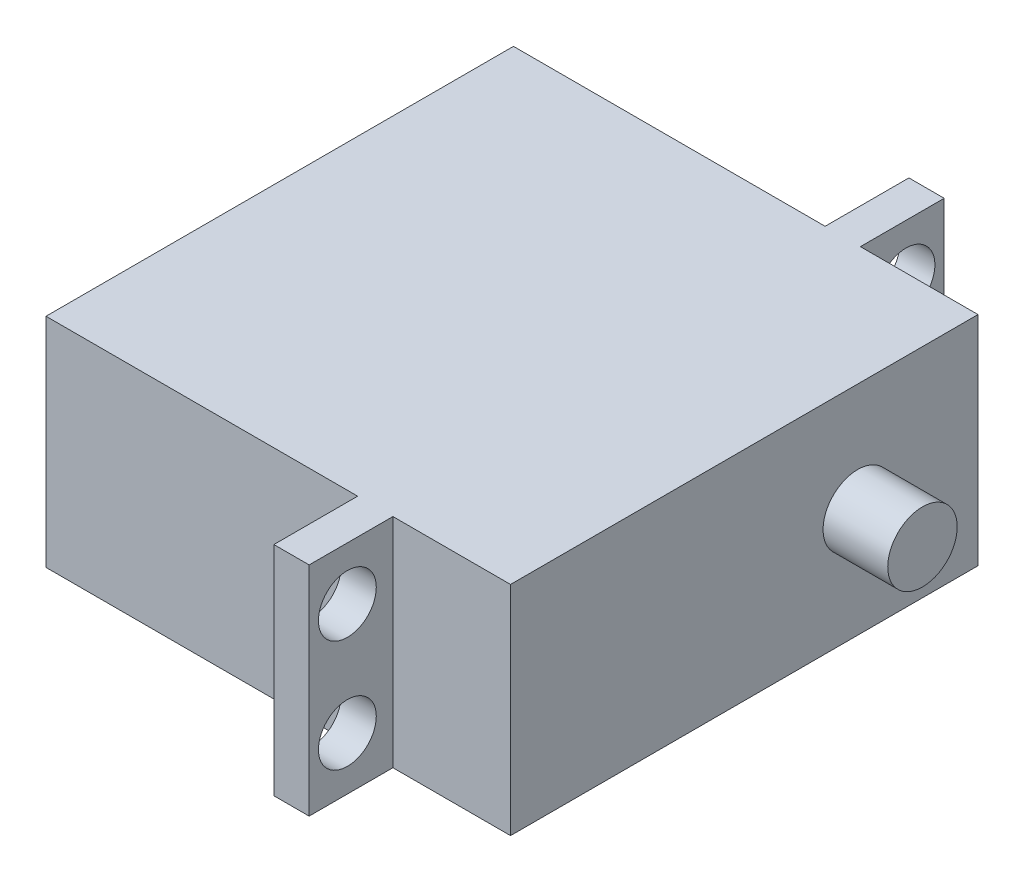
ISO-10303-21;
HEADER;
FILE_DESCRIPTION(('STEP AP214'),'2;1');
FILE_NAME('part.step','',(''),(''),'','','');
FILE_SCHEMA(('AUTOMOTIVE_DESIGN { 1 0 10303 214 1 1 1 1 }'));
ENDSEC;
DATA;
#1=APPLICATION_CONTEXT('core data for automotive mechanical design processes');
#2=APPLICATION_PROTOCOL_DEFINITION('international standard','automotive_design',2000,#1);
#3=PRODUCT_CONTEXT('',#1,'mechanical');
#4=PRODUCT('Part','Part','',(#3));
#5=PRODUCT_RELATED_PRODUCT_CATEGORY('part','',(#4));
#6=PRODUCT_DEFINITION_FORMATION('','',#4);
#7=PRODUCT_DEFINITION_CONTEXT('part definition',#1,'design');
#8=PRODUCT_DEFINITION('design','',#6,#7);
#9=PRODUCT_DEFINITION_SHAPE('','',#8);
#10=(LENGTH_UNIT() NAMED_UNIT(*) SI_UNIT(.MILLI.,.METRE.));
#11=(NAMED_UNIT(*) PLANE_ANGLE_UNIT() SI_UNIT($,.RADIAN.));
#12=(NAMED_UNIT(*) SI_UNIT($,.STERADIAN.) SOLID_ANGLE_UNIT());
#13=UNCERTAINTY_MEASURE_WITH_UNIT(LENGTH_MEASURE(1.E-05),#10,'distance_accuracy_value','');
#14=(GEOMETRIC_REPRESENTATION_CONTEXT(3) GLOBAL_UNCERTAINTY_ASSIGNED_CONTEXT((#13)) GLOBAL_UNIT_ASSIGNED_CONTEXT((#10,
#11,#12)) REPRESENTATION_CONTEXT('',''));
#15=CARTESIAN_POINT('',(0.,0.,0.));
#16=DIRECTION('',(0.,0.,1.));
#17=DIRECTION('',(1.,0.,0.));
#18=AXIS2_PLACEMENT_3D('',#15,#16,#17);
#19=CARTESIAN_POINT('',(40.132,0.,0.));
#20=DIRECTION('',(0.,0.,1.));
#21=DIRECTION('',(0.,-1.,0.));
#22=AXIS2_PLACEMENT_3D('',#19,#20,#21);
#23=PLANE('',#22);
#24=DIRECTION('',(0.,-1.,0.));
#25=VECTOR('',#24,1.);
#26=CARTESIAN_POINT('',(29.972,0.,0.));
#27=LINE('',#26,#25);
#28=CARTESIAN_POINT('',(29.972,0.,0.));
#29=VERTEX_POINT('',#28);
#30=CARTESIAN_POINT('',(29.972,-18.796,0.));
#31=VERTEX_POINT('',#30);
#32=EDGE_CURVE('E132',#29,#31,#27,.T.);
#33=ORIENTED_EDGE('',*,*,#32,.F.);
#34=DIRECTION('',(-1.,0.,0.));
#35=VECTOR('',#34,1.);
#36=CARTESIAN_POINT('',(40.132,0.,0.));
#37=LINE('',#36,#35);
#38=CARTESIAN_POINT('',(40.132,0.,0.));
#39=VERTEX_POINT('',#38);
#40=EDGE_CURVE('E48',#39,#29,#37,.T.);
#41=ORIENTED_EDGE('',*,*,#40,.F.);
#42=DIRECTION('',(0.,1.,0.));
#43=VECTOR('',#42,1.);
#44=CARTESIAN_POINT('',(40.132,0.,0.));
#45=LINE('',#44,#43);
#46=CARTESIAN_POINT('',(40.132,-18.796,0.));
#47=VERTEX_POINT('',#46);
#48=EDGE_CURVE('E135',#47,#39,#45,.T.);
#49=ORIENTED_EDGE('',*,*,#48,.F.);
#50=DIRECTION('',(-1.,0.,0.));
#51=VECTOR('',#50,1.);
#52=CARTESIAN_POINT('',(40.132,-18.796,0.));
#53=LINE('',#52,#51);
#54=EDGE_CURVE('E128',#47,#31,#53,.T.);
#55=ORIENTED_EDGE('',*,*,#54,.T.);
#56=EDGE_LOOP('',(#33,#41,#49,#55));
#57=FACE_BOUND('',#56,.T.);
#58=ADVANCED_FACE('F39',(#57),#23,.F.);
#59=CARTESIAN_POINT('',(40.132,0.,40.386));
#60=DIRECTION('',(0.,0.,-1.));
#61=DIRECTION('',(-1.,0.,0.));
#62=AXIS2_PLACEMENT_3D('',#59,#60,#61);
#63=PLANE('',#62);
#64=DIRECTION('',(0.,1.,0.));
#65=VECTOR('',#64,1.);
#66=CARTESIAN_POINT('',(29.972,0.,40.386));
#67=LINE('',#66,#65);
#68=CARTESIAN_POINT('',(29.972,-18.796,40.386));
#69=VERTEX_POINT('',#68);
#70=CARTESIAN_POINT('',(29.972,0.,40.386));
#71=VERTEX_POINT('',#70);
#72=EDGE_CURVE('E203',#69,#71,#67,.T.);
#73=ORIENTED_EDGE('',*,*,#72,.F.);
#74=DIRECTION('',(-1.,0.,0.));
#75=VECTOR('',#74,1.);
#76=CARTESIAN_POINT('',(40.132,-18.796,40.386));
#77=LINE('',#76,#75);
#78=CARTESIAN_POINT('',(40.132,-18.796,40.386));
#79=VERTEX_POINT('',#78);
#80=EDGE_CURVE('E262',#79,#69,#77,.T.);
#81=ORIENTED_EDGE('',*,*,#80,.F.);
#82=DIRECTION('',(0.,-1.,0.));
#83=VECTOR('',#82,1.);
#84=CARTESIAN_POINT('',(40.132,0.,40.386));
#85=LINE('',#84,#83);
#86=CARTESIAN_POINT('',(40.132,0.,40.386));
#87=VERTEX_POINT('',#86);
#88=EDGE_CURVE('E244',#87,#79,#85,.T.);
#89=ORIENTED_EDGE('',*,*,#88,.F.);
#90=DIRECTION('',(-1.,0.,0.));
#91=VECTOR('',#90,1.);
#92=CARTESIAN_POINT('',(40.132,0.,40.386));
#93=LINE('',#92,#91);
#94=EDGE_CURVE('E267',#87,#71,#93,.T.);
#95=ORIENTED_EDGE('',*,*,#94,.T.);
#96=EDGE_LOOP('',(#73,#81,#89,#95));
#97=FACE_BOUND('',#96,.T.);
#98=ADVANCED_FACE('F308',(#97),#63,.F.);
#99=CARTESIAN_POINT('',(26.924,0.,0.));
#100=VERTEX_POINT('',#99);
#101=CARTESIAN_POINT('',(0.,0.,0.));
#102=VERTEX_POINT('',#101);
#103=EDGE_CURVE('E60',#100,#102,#37,.T.);
#104=ORIENTED_EDGE('',*,*,#103,.F.);
#105=DIRECTION('',(0.,-1.,0.));
#106=VECTOR('',#105,1.);
#107=CARTESIAN_POINT('',(26.924,0.,0.));
#108=LINE('',#107,#106);
#109=CARTESIAN_POINT('',(26.924,-18.796,0.));
#110=VERTEX_POINT('',#109);
#111=EDGE_CURVE('E55',#100,#110,#108,.T.);
#112=ORIENTED_EDGE('',*,*,#111,.T.);
#113=CARTESIAN_POINT('',(0.,-18.796,0.));
#114=VERTEX_POINT('',#113);
#115=EDGE_CURVE('E140',#110,#114,#53,.T.);
#116=ORIENTED_EDGE('',*,*,#115,.T.);
#117=DIRECTION('',(0.,1.,0.));
#118=VECTOR('',#117,1.);
#119=CARTESIAN_POINT('',(0.,0.,0.));
#120=LINE('',#119,#118);
#121=EDGE_CURVE('E237',#114,#102,#120,.T.);
#122=ORIENTED_EDGE('',*,*,#121,.T.);
#123=EDGE_LOOP('',(#104,#112,#116,#122));
#124=FACE_BOUND('',#123,.T.);
#125=ADVANCED_FACE('F41',(#124),#23,.F.);
#126=CARTESIAN_POINT('',(40.132,0.,0.));
#127=DIRECTION('',(0.,-1.,0.));
#128=DIRECTION('',(0.,0.,-1.));
#129=AXIS2_PLACEMENT_3D('',#126,#127,#128);
#130=PLANE('',#129);
#131=DIRECTION('',(0.,0.,1.));
#132=VECTOR('',#131,1.);
#133=CARTESIAN_POINT('',(0.,0.,0.));
#134=LINE('',#133,#132);
#135=CARTESIAN_POINT('',(0.,0.,40.386));
#136=VERTEX_POINT('',#135);
#137=EDGE_CURVE('E252',#102,#136,#134,.T.);
#138=ORIENTED_EDGE('',*,*,#137,.T.);
#139=CARTESIAN_POINT('',(26.924,0.,40.386));
#140=VERTEX_POINT('',#139);
#141=EDGE_CURVE('E266',#140,#136,#93,.T.);
#142=ORIENTED_EDGE('',*,*,#141,.F.);
#143=DIRECTION('',(0.,0.,1.));
#144=VECTOR('',#143,1.);
#145=CARTESIAN_POINT('',(26.924,0.,40.386));
#146=LINE('',#145,#144);
#147=CARTESIAN_POINT('',(26.924,0.,47.625));
#148=VERTEX_POINT('',#147);
#149=EDGE_CURVE('E221',#140,#148,#146,.T.);
#150=ORIENTED_EDGE('',*,*,#149,.T.);
#151=DIRECTION('',(-1.,0.,0.));
#152=VECTOR('',#151,1.);
#153=CARTESIAN_POINT('',(29.972,0.,47.625));
#154=LINE('',#153,#152);
#155=CARTESIAN_POINT('',(29.972,0.,47.625));
#156=VERTEX_POINT('',#155);
#157=EDGE_CURVE('E233',#156,#148,#154,.T.);
#158=ORIENTED_EDGE('',*,*,#157,.F.);
#159=DIRECTION('',(0.,0.,1.));
#160=VECTOR('',#159,1.);
#161=CARTESIAN_POINT('',(29.972,0.,40.386));
#162=LINE('',#161,#160);
#163=EDGE_CURVE('E207',#71,#156,#162,.T.);
#164=ORIENTED_EDGE('',*,*,#163,.F.);
#165=ORIENTED_EDGE('',*,*,#94,.F.);
#166=DIRECTION('',(0.,0.,1.));
#167=VECTOR('',#166,1.);
#168=CARTESIAN_POINT('',(40.132,0.,0.));
#169=LINE('',#168,#167);
#170=EDGE_CURVE('E240',#39,#87,#169,.T.);
#171=ORIENTED_EDGE('',*,*,#170,.F.);
#172=ORIENTED_EDGE('',*,*,#40,.T.);
#173=DIRECTION('',(0.,0.,1.));
#174=VECTOR('',#173,1.);
#175=CARTESIAN_POINT('',(29.972,0.,0.));
#176=LINE('',#175,#174);
#177=CARTESIAN_POINT('',(29.972,0.,-7.239));
#178=VERTEX_POINT('',#177);
#179=EDGE_CURVE('E157',#178,#29,#176,.T.);
#180=ORIENTED_EDGE('',*,*,#179,.F.);
#181=DIRECTION('',(-1.,0.,0.));
#182=VECTOR('',#181,1.);
#183=CARTESIAN_POINT('',(29.972,0.,-7.239));
#184=LINE('',#183,#182);
#185=CARTESIAN_POINT('',(26.924,0.,-7.239));
#186=VERTEX_POINT('',#185);
#187=EDGE_CURVE('E172',#178,#186,#184,.T.);
#188=ORIENTED_EDGE('',*,*,#187,.T.);
#189=DIRECTION('',(0.,0.,1.));
#190=VECTOR('',#189,1.);
#191=CARTESIAN_POINT('',(26.924,0.,0.));
#192=LINE('',#191,#190);
#193=EDGE_CURVE('E159',#186,#100,#192,.T.);
#194=ORIENTED_EDGE('',*,*,#193,.T.);
#195=ORIENTED_EDGE('',*,*,#103,.T.);
#196=EDGE_LOOP('',(#138,#142,#150,#158,#164,#165,#171,#172,#180,#188,#194,#195));
#197=FACE_BOUND('',#196,.T.);
#198=ADVANCED_FACE('F273',(#197),#130,.F.);
#199=CARTESIAN_POINT('',(26.924,-18.796,40.386));
#200=VERTEX_POINT('',#199);
#201=CARTESIAN_POINT('',(0.,-18.796,40.386));
#202=VERTEX_POINT('',#201);
#203=EDGE_CURVE('E139',#200,#202,#77,.T.);
#204=ORIENTED_EDGE('',*,*,#203,.F.);
#205=DIRECTION('',(0.,1.,0.));
#206=VECTOR('',#205,1.);
#207=CARTESIAN_POINT('',(26.924,0.,40.386));
#208=LINE('',#207,#206);
#209=EDGE_CURVE('E199',#200,#140,#208,.T.);
#210=ORIENTED_EDGE('',*,*,#209,.T.);
#211=ORIENTED_EDGE('',*,*,#141,.T.);
#212=DIRECTION('',(0.,-1.,0.));
#213=VECTOR('',#212,1.);
#214=CARTESIAN_POINT('',(0.,0.,40.386));
#215=LINE('',#214,#213);
#216=EDGE_CURVE('E256',#136,#202,#215,.T.);
#217=ORIENTED_EDGE('',*,*,#216,.T.);
#218=EDGE_LOOP('',(#204,#210,#211,#217));
#219=FACE_BOUND('',#218,.T.);
#220=ADVANCED_FACE('F287',(#219),#63,.F.);
#221=CARTESIAN_POINT('',(40.132,-18.796,0.));
#222=DIRECTION('',(0.,1.,0.));
#223=DIRECTION('',(0.,0.,1.));
#224=AXIS2_PLACEMENT_3D('',#221,#222,#223);
#225=PLANE('',#224);
#226=DIRECTION('',(0.,0.,-1.));
#227=VECTOR('',#226,1.);
#228=CARTESIAN_POINT('',(0.,-18.796,0.));
#229=LINE('',#228,#227);
#230=EDGE_CURVE('E241',#202,#114,#229,.T.);
#231=ORIENTED_EDGE('',*,*,#230,.T.);
#232=ORIENTED_EDGE('',*,*,#115,.F.);
#233=DIRECTION('',(0.,0.,-1.));
#234=VECTOR('',#233,1.);
#235=CARTESIAN_POINT('',(26.924,-18.796,0.));
#236=LINE('',#235,#234);
#237=CARTESIAN_POINT('',(26.924,-18.796,-7.239));
#238=VERTEX_POINT('',#237);
#239=EDGE_CURVE('E175',#110,#238,#236,.T.);
#240=ORIENTED_EDGE('',*,*,#239,.T.);
#241=DIRECTION('',(-1.,0.,0.));
#242=VECTOR('',#241,1.);
#243=CARTESIAN_POINT('',(29.972,-18.796,-7.239));
#244=LINE('',#243,#242);
#245=CARTESIAN_POINT('',(29.972,-18.796,-7.239));
#246=VERTEX_POINT('',#245);
#247=EDGE_CURVE('E147',#246,#238,#244,.T.);
#248=ORIENTED_EDGE('',*,*,#247,.F.);
#249=DIRECTION('',(0.,0.,-1.));
#250=VECTOR('',#249,1.);
#251=CARTESIAN_POINT('',(29.972,-18.796,0.));
#252=LINE('',#251,#250);
#253=EDGE_CURVE('E143',#31,#246,#252,.T.);
#254=ORIENTED_EDGE('',*,*,#253,.F.);
#255=ORIENTED_EDGE('',*,*,#54,.F.);
#256=DIRECTION('',(0.,0.,-1.));
#257=VECTOR('',#256,1.);
#258=CARTESIAN_POINT('',(40.132,-18.796,0.));
#259=LINE('',#258,#257);
#260=EDGE_CURVE('E247',#79,#47,#259,.T.);
#261=ORIENTED_EDGE('',*,*,#260,.F.);
#262=ORIENTED_EDGE('',*,*,#80,.T.);
#263=DIRECTION('',(0.,0.,-1.));
#264=VECTOR('',#263,1.);
#265=CARTESIAN_POINT('',(29.972,-18.796,40.386));
#266=LINE('',#265,#264);
#267=CARTESIAN_POINT('',(29.972,-18.796,47.625));
#268=VERTEX_POINT('',#267);
#269=EDGE_CURVE('E214',#268,#69,#266,.T.);
#270=ORIENTED_EDGE('',*,*,#269,.F.);
#271=DIRECTION('',(-1.,0.,0.));
#272=VECTOR('',#271,1.);
#273=CARTESIAN_POINT('',(29.972,-18.796,47.625));
#274=LINE('',#273,#272);
#275=CARTESIAN_POINT('',(26.924,-18.796,47.625));
#276=VERTEX_POINT('',#275);
#277=EDGE_CURVE('E218',#268,#276,#274,.T.);
#278=ORIENTED_EDGE('',*,*,#277,.T.);
#279=DIRECTION('',(0.,0.,-1.));
#280=VECTOR('',#279,1.);
#281=CARTESIAN_POINT('',(26.924,-18.796,40.386));
#282=LINE('',#281,#280);
#283=EDGE_CURVE('E208',#276,#200,#282,.T.);
#284=ORIENTED_EDGE('',*,*,#283,.T.);
#285=ORIENTED_EDGE('',*,*,#203,.T.);
#286=EDGE_LOOP('',(#231,#232,#240,#248,#254,#255,#261,#262,#270,#278,#284,#285));
#287=FACE_BOUND('',#286,.T.);
#288=ADVANCED_FACE('F145',(#287),#225,.F.);
#289=CARTESIAN_POINT('',(40.132,0.,0.));
#290=DIRECTION('',(-1.,0.,0.));
#291=DIRECTION('',(0.,0.,1.));
#292=AXIS2_PLACEMENT_3D('',#289,#290,#291);
#293=PLANE('',#292);
#294=CARTESIAN_POINT('',(40.132,-9.398,10.386));
#295=DIRECTION('',(-1.,0.,0.));
#296=DIRECTION('',(0.,0.,1.));
#297=AXIS2_PLACEMENT_3D('',#294,#295,#296);
#298=CIRCLE('',#297,3.);
#299=CARTESIAN_POINT('',(40.132,-9.398,13.386));
#300=VERTEX_POINT('',#299);
#301=EDGE_CURVE('E11',#300,#300,#298,.F.);
#302=ORIENTED_EDGE('',*,*,#301,.F.);
#303=EDGE_LOOP('',(#302));
#304=FACE_BOUND('',#303,.T.);
#305=ORIENTED_EDGE('',*,*,#48,.T.);
#306=ORIENTED_EDGE('',*,*,#170,.T.);
#307=ORIENTED_EDGE('',*,*,#88,.T.);
#308=ORIENTED_EDGE('',*,*,#260,.T.);
#309=EDGE_LOOP('',(#305,#306,#307,#308));
#310=FACE_BOUND('',#309,.T.);
#311=ADVANCED_FACE('F310',(#304,#310),#293,.F.);
#312=CARTESIAN_POINT('',(0.,0.,0.));
#313=DIRECTION('',(-1.,0.,0.));
#314=DIRECTION('',(0.,0.,1.));
#315=AXIS2_PLACEMENT_3D('',#312,#313,#314);
#316=PLANE('',#315);
#317=ORIENTED_EDGE('',*,*,#121,.F.);
#318=ORIENTED_EDGE('',*,*,#230,.F.);
#319=ORIENTED_EDGE('',*,*,#216,.F.);
#320=ORIENTED_EDGE('',*,*,#137,.F.);
#321=EDGE_LOOP('',(#317,#318,#319,#320));
#322=FACE_BOUND('',#321,.T.);
#323=ADVANCED_FACE('F279',(#322),#316,.T.);
#324=CARTESIAN_POINT('',(29.972,0.,0.));
#325=DIRECTION('',(-1.,0.,0.));
#326=DIRECTION('',(0.,0.,1.));
#327=AXIS2_PLACEMENT_3D('',#324,#325,#326);
#328=PLANE('',#327);
#329=ORIENTED_EDGE('',*,*,#72,.T.);
#330=ORIENTED_EDGE('',*,*,#163,.T.);
#331=DIRECTION('',(0.,-1.,0.));
#332=VECTOR('',#331,1.);
#333=CARTESIAN_POINT('',(29.972,0.,47.625));
#334=LINE('',#333,#332);
#335=EDGE_CURVE('E211',#156,#268,#334,.T.);
#336=ORIENTED_EDGE('',*,*,#335,.T.);
#337=ORIENTED_EDGE('',*,*,#269,.T.);
#338=EDGE_LOOP('',(#329,#330,#336,#337));
#339=FACE_BOUND('',#338,.T.);
#340=CARTESIAN_POINT('',(29.972,-4.572,44.323));
#341=DIRECTION('',(1.,0.,0.));
#342=DIRECTION('',(0.,0.,-1.));
#343=AXIS2_PLACEMENT_3D('',#340,#341,#342);
#344=CIRCLE('',#343,2.5);
#345=CARTESIAN_POINT('',(29.972,-4.572,41.823));
#346=VERTEX_POINT('',#345);
#347=EDGE_CURVE('E195',#346,#346,#344,.T.);
#348=ORIENTED_EDGE('',*,*,#347,.F.);
#349=EDGE_LOOP('',(#348));
#350=FACE_BOUND('',#349,.T.);
#351=CARTESIAN_POINT('',(29.972,-14.224,44.323));
#352=DIRECTION('',(1.,0.,0.));
#353=DIRECTION('',(0.,0.,-1.));
#354=AXIS2_PLACEMENT_3D('',#351,#352,#353);
#355=CIRCLE('',#354,2.5);
#356=CARTESIAN_POINT('',(29.972,-14.224,41.823));
#357=VERTEX_POINT('',#356);
#358=EDGE_CURVE('E187',#357,#357,#355,.T.);
#359=ORIENTED_EDGE('',*,*,#358,.F.);
#360=EDGE_LOOP('',(#359));
#361=FACE_BOUND('',#360,.T.);
#362=ADVANCED_FACE('F302',(#339,#350,#361),#328,.F.);
#363=CARTESIAN_POINT('',(26.924,0.,0.));
#364=DIRECTION('',(-1.,0.,0.));
#365=DIRECTION('',(0.,0.,1.));
#366=AXIS2_PLACEMENT_3D('',#363,#364,#365);
#367=PLANE('',#366);
#368=CARTESIAN_POINT('',(26.924,-4.572,44.323));
#369=DIRECTION('',(1.,0.,0.));
#370=DIRECTION('',(0.,0.,-1.));
#371=AXIS2_PLACEMENT_3D('',#368,#369,#370);
#372=CIRCLE('',#371,2.5);
#373=CARTESIAN_POINT('',(26.924,-4.572,41.823));
#374=VERTEX_POINT('',#373);
#375=EDGE_CURVE('E191',#374,#374,#372,.T.);
#376=ORIENTED_EDGE('',*,*,#375,.T.);
#377=EDGE_LOOP('',(#376));
#378=FACE_BOUND('',#377,.T.);
#379=ORIENTED_EDGE('',*,*,#209,.F.);
#380=ORIENTED_EDGE('',*,*,#283,.F.);
#381=DIRECTION('',(0.,-1.,0.));
#382=VECTOR('',#381,1.);
#383=CARTESIAN_POINT('',(26.924,0.,47.625));
#384=LINE('',#383,#382);
#385=EDGE_CURVE('E224',#148,#276,#384,.T.);
#386=ORIENTED_EDGE('',*,*,#385,.F.);
#387=ORIENTED_EDGE('',*,*,#149,.F.);
#388=EDGE_LOOP('',(#379,#380,#386,#387));
#389=FACE_BOUND('',#388,.T.);
#390=CARTESIAN_POINT('',(26.924,-14.224,44.323));
#391=DIRECTION('',(1.,0.,0.));
#392=DIRECTION('',(0.,0.,-1.));
#393=AXIS2_PLACEMENT_3D('',#390,#391,#392);
#394=CIRCLE('',#393,2.5);
#395=CARTESIAN_POINT('',(26.924,-14.224,41.823));
#396=VERTEX_POINT('',#395);
#397=EDGE_CURVE('E186',#396,#396,#394,.T.);
#398=ORIENTED_EDGE('',*,*,#397,.T.);
#399=EDGE_LOOP('',(#398));
#400=FACE_BOUND('',#399,.T.);
#401=ADVANCED_FACE('F293',(#378,#389,#400),#367,.T.);
#402=CARTESIAN_POINT('',(29.972,0.,47.625));
#403=DIRECTION('',(0.,0.,-1.));
#404=DIRECTION('',(-1.,0.,0.));
#405=AXIS2_PLACEMENT_3D('',#402,#403,#404);
#406=PLANE('',#405);
#407=ORIENTED_EDGE('',*,*,#385,.T.);
#408=ORIENTED_EDGE('',*,*,#277,.F.);
#409=ORIENTED_EDGE('',*,*,#335,.F.);
#410=ORIENTED_EDGE('',*,*,#157,.T.);
#411=EDGE_LOOP('',(#407,#408,#409,#410));
#412=FACE_BOUND('',#411,.T.);
#413=ADVANCED_FACE('F297',(#412),#406,.F.);
#414=CARTESIAN_POINT('',(29.972,-4.572,44.323));
#415=DIRECTION('',(-1.,0.,0.));
#416=DIRECTION('',(0.,0.,1.));
#417=AXIS2_PLACEMENT_3D('',#414,#415,#416);
#418=CYLINDRICAL_SURFACE('',#417,2.5);
#419=ORIENTED_EDGE('',*,*,#347,.T.);
#420=EDGE_LOOP('',(#419));
#421=FACE_BOUND('',#420,.T.);
#422=ORIENTED_EDGE('',*,*,#375,.F.);
#423=EDGE_LOOP('',(#422));
#424=FACE_BOUND('',#423,.T.);
#425=ADVANCED_FACE('F367',(#421,#424),#418,.F.);
#426=CARTESIAN_POINT('',(29.972,-14.224,44.323));
#427=DIRECTION('',(-1.,0.,0.));
#428=DIRECTION('',(0.,0.,1.));
#429=AXIS2_PLACEMENT_3D('',#426,#427,#428);
#430=CYLINDRICAL_SURFACE('',#429,2.5);
#431=ORIENTED_EDGE('',*,*,#358,.T.);
#432=EDGE_LOOP('',(#431));
#433=FACE_BOUND('',#432,.T.);
#434=ORIENTED_EDGE('',*,*,#397,.F.);
#435=EDGE_LOOP('',(#434));
#436=FACE_BOUND('',#435,.T.);
#437=ADVANCED_FACE('F375',(#433,#436),#430,.F.);
#438=CARTESIAN_POINT('',(29.972,0.,0.));
#439=DIRECTION('',(1.,0.,0.));
#440=DIRECTION('',(0.,0.,-1.));
#441=AXIS2_PLACEMENT_3D('',#438,#439,#440);
#442=PLANE('',#441);
#443=CARTESIAN_POINT('',(29.972,-4.572,-3.937));
#444=DIRECTION('',(1.,0.,0.));
#445=DIRECTION('',(0.,0.,1.));
#446=AXIS2_PLACEMENT_3D('',#443,#444,#445);
#447=CIRCLE('',#446,2.5);
#448=CARTESIAN_POINT('',(29.972,-4.572,-1.437));
#449=VERTEX_POINT('',#448);
#450=EDGE_CURVE('E176',#449,#449,#447,.T.);
#451=ORIENTED_EDGE('',*,*,#450,.F.);
#452=EDGE_LOOP('',(#451));
#453=FACE_BOUND('',#452,.T.);
#454=ORIENTED_EDGE('',*,*,#32,.T.);
#455=ORIENTED_EDGE('',*,*,#253,.T.);
#456=DIRECTION('',(0.,1.,0.));
#457=VECTOR('',#456,1.);
#458=CARTESIAN_POINT('',(29.972,0.,-7.239));
#459=LINE('',#458,#457);
#460=EDGE_CURVE('E151',#246,#178,#459,.T.);
#461=ORIENTED_EDGE('',*,*,#460,.T.);
#462=ORIENTED_EDGE('',*,*,#179,.T.);
#463=EDGE_LOOP('',(#454,#455,#461,#462));
#464=FACE_BOUND('',#463,.T.);
#465=CARTESIAN_POINT('',(29.972,-14.224,-3.937));
#466=DIRECTION('',(1.,0.,0.));
#467=DIRECTION('',(0.,0.,1.));
#468=AXIS2_PLACEMENT_3D('',#465,#466,#467);
#469=CIRCLE('',#468,2.5);
#470=CARTESIAN_POINT('',(29.972,-14.224,-1.437));
#471=VERTEX_POINT('',#470);
#472=EDGE_CURVE('E472',#471,#471,#469,.T.);
#473=ORIENTED_EDGE('',*,*,#472,.F.);
#474=EDGE_LOOP('',(#473));
#475=FACE_BOUND('',#474,.T.);
#476=ADVANCED_FACE('F154',(#453,#464,#475),#442,.T.);
#477=CARTESIAN_POINT('',(26.924,0.,0.));
#478=DIRECTION('',(1.,0.,0.));
#479=DIRECTION('',(0.,0.,-1.));
#480=AXIS2_PLACEMENT_3D('',#477,#478,#479);
#481=PLANE('',#480);
#482=ORIENTED_EDGE('',*,*,#111,.F.);
#483=ORIENTED_EDGE('',*,*,#193,.F.);
#484=DIRECTION('',(0.,1.,0.));
#485=VECTOR('',#484,1.);
#486=CARTESIAN_POINT('',(26.924,0.,-7.239));
#487=LINE('',#486,#485);
#488=EDGE_CURVE('E162',#238,#186,#487,.T.);
#489=ORIENTED_EDGE('',*,*,#488,.F.);
#490=ORIENTED_EDGE('',*,*,#239,.F.);
#491=EDGE_LOOP('',(#482,#483,#489,#490));
#492=FACE_BOUND('',#491,.T.);
#493=CARTESIAN_POINT('',(26.924,-4.572,-3.937));
#494=DIRECTION('',(1.,0.,0.));
#495=DIRECTION('',(0.,0.,1.));
#496=AXIS2_PLACEMENT_3D('',#493,#494,#495);
#497=CIRCLE('',#496,2.5);
#498=CARTESIAN_POINT('',(26.924,-4.572,-1.437));
#499=VERTEX_POINT('',#498);
#500=EDGE_CURVE('E165',#499,#499,#497,.T.);
#501=ORIENTED_EDGE('',*,*,#500,.T.);
#502=EDGE_LOOP('',(#501));
#503=FACE_BOUND('',#502,.T.);
#504=CARTESIAN_POINT('',(26.924,-14.224,-3.937));
#505=DIRECTION('',(1.,0.,0.));
#506=DIRECTION('',(0.,0.,1.));
#507=AXIS2_PLACEMENT_3D('',#504,#505,#506);
#508=CIRCLE('',#507,2.5);
#509=CARTESIAN_POINT('',(26.924,-14.224,-1.437));
#510=VERTEX_POINT('',#509);
#511=EDGE_CURVE('E468',#510,#510,#508,.T.);
#512=ORIENTED_EDGE('',*,*,#511,.T.);
#513=EDGE_LOOP('',(#512));
#514=FACE_BOUND('',#513,.T.);
#515=ADVANCED_FACE('F394',(#492,#503,#514),#481,.F.);
#516=CARTESIAN_POINT('',(29.972,0.,-7.239));
#517=DIRECTION('',(0.,0.,1.));
#518=DIRECTION('',(1.,0.,0.));
#519=AXIS2_PLACEMENT_3D('',#516,#517,#518);
#520=PLANE('',#519);
#521=ORIENTED_EDGE('',*,*,#488,.T.);
#522=ORIENTED_EDGE('',*,*,#187,.F.);
#523=ORIENTED_EDGE('',*,*,#460,.F.);
#524=ORIENTED_EDGE('',*,*,#247,.T.);
#525=EDGE_LOOP('',(#521,#522,#523,#524));
#526=FACE_BOUND('',#525,.T.);
#527=ADVANCED_FACE('F404',(#526),#520,.F.);
#528=CARTESIAN_POINT('',(29.972,-4.572,-3.937));
#529=DIRECTION('',(-1.,0.,0.));
#530=DIRECTION('',(0.,0.,1.));
#531=AXIS2_PLACEMENT_3D('',#528,#529,#530);
#532=CYLINDRICAL_SURFACE('',#531,2.5);
#533=ORIENTED_EDGE('',*,*,#450,.T.);
#534=EDGE_LOOP('',(#533));
#535=FACE_BOUND('',#534,.T.);
#536=ORIENTED_EDGE('',*,*,#500,.F.);
#537=EDGE_LOOP('',(#536));
#538=FACE_BOUND('',#537,.T.);
#539=ADVANCED_FACE('F414',(#535,#538),#532,.F.);
#540=CARTESIAN_POINT('',(29.972,-14.224,-3.937));
#541=DIRECTION('',(-1.,0.,0.));
#542=DIRECTION('',(0.,0.,1.));
#543=AXIS2_PLACEMENT_3D('',#540,#541,#542);
#544=CYLINDRICAL_SURFACE('',#543,2.5);
#545=ORIENTED_EDGE('',*,*,#472,.T.);
#546=EDGE_LOOP('',(#545));
#547=FACE_BOUND('',#546,.T.);
#548=ORIENTED_EDGE('',*,*,#511,.F.);
#549=EDGE_LOOP('',(#548));
#550=FACE_BOUND('',#549,.T.);
#551=ADVANCED_FACE('F424',(#547,#550),#544,.F.);
#552=CARTESIAN_POINT('',(45.72,-9.398,10.386));
#553=DIRECTION('',(-1.,0.,0.));
#554=DIRECTION('',(0.,0.,1.));
#555=AXIS2_PLACEMENT_3D('',#552,#553,#554);
#556=CYLINDRICAL_SURFACE('',#555,3.);
#557=CARTESIAN_POINT('',(45.72,-9.398,10.386));
#558=DIRECTION('',(1.,0.,0.));
#559=DIRECTION('',(0.,0.,-1.));
#560=AXIS2_PLACEMENT_3D('',#557,#558,#559);
#561=CIRCLE('',#560,3.);
#562=CARTESIAN_POINT('',(45.72,-9.398,7.386));
#563=VERTEX_POINT('',#562);
#564=EDGE_CURVE('E466',#563,#563,#561,.T.);
#565=ORIENTED_EDGE('',*,*,#564,.F.);
#566=EDGE_LOOP('',(#565));
#567=FACE_BOUND('',#566,.T.);
#568=ORIENTED_EDGE('',*,*,#301,.T.);
#569=EDGE_LOOP('',(#568));
#570=FACE_BOUND('',#569,.T.);
#571=ADVANCED_FACE('F433',(#567,#570),#556,.T.);
#572=CARTESIAN_POINT('',(45.72,-9.398,10.386));
#573=DIRECTION('',(1.,0.,0.));
#574=DIRECTION('',(0.,0.,-1.));
#575=AXIS2_PLACEMENT_3D('',#572,#573,#574);
#576=PLANE('',#575);
#577=ORIENTED_EDGE('',*,*,#564,.T.);
#578=EDGE_LOOP('',(#577));
#579=FACE_BOUND('',#578,.T.);
#580=ADVANCED_FACE('F450',(#579),#576,.T.);
#581=CLOSED_SHELL('',(#58,#98,#125,#198,#220,#288,#311,#323,#362,#401,#413,#425,#437,#476,#515,
#527,#539,#551,#571,#580));
#582=MANIFOLD_SOLID_BREP('B2',#581);
#583=ADVANCED_BREP_SHAPE_REPRESENTATION('',(#18,#582),#14);
#584=SHAPE_DEFINITION_REPRESENTATION(#9,#583);
ENDSEC;
END-ISO-10303-21;
